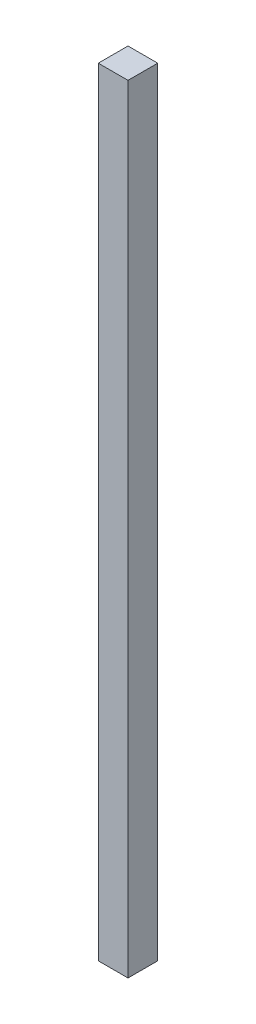
ISO-10303-21;
HEADER;
FILE_DESCRIPTION(('STEP AP214'),'2;1');
FILE_NAME('part.step','',(''),(''),'','','');
FILE_SCHEMA(('AUTOMOTIVE_DESIGN { 1 0 10303 214 1 1 1 1 }'));
ENDSEC;
DATA;
#1=APPLICATION_CONTEXT('core data for automotive mechanical design processes');
#2=APPLICATION_PROTOCOL_DEFINITION('international standard','automotive_design',2000,#1);
#3=PRODUCT_CONTEXT('',#1,'mechanical');
#4=PRODUCT('Part','Part','',(#3));
#5=PRODUCT_RELATED_PRODUCT_CATEGORY('part','',(#4));
#6=PRODUCT_DEFINITION_FORMATION('','',#4);
#7=PRODUCT_DEFINITION_CONTEXT('part definition',#1,'design');
#8=PRODUCT_DEFINITION('design','',#6,#7);
#9=PRODUCT_DEFINITION_SHAPE('','',#8);
#10=(LENGTH_UNIT() NAMED_UNIT(*) SI_UNIT(.MILLI.,.METRE.));
#11=(NAMED_UNIT(*) PLANE_ANGLE_UNIT() SI_UNIT($,.RADIAN.));
#12=(NAMED_UNIT(*) SI_UNIT($,.STERADIAN.) SOLID_ANGLE_UNIT());
#13=UNCERTAINTY_MEASURE_WITH_UNIT(LENGTH_MEASURE(1.E-05),#10,'distance_accuracy_value','');
#14=(GEOMETRIC_REPRESENTATION_CONTEXT(3) GLOBAL_UNCERTAINTY_ASSIGNED_CONTEXT((#13)) GLOBAL_UNIT_ASSIGNED_CONTEXT((#10,
#11,#12)) REPRESENTATION_CONTEXT('',''));
#15=CARTESIAN_POINT('',(0.,0.,0.));
#16=DIRECTION('',(0.,0.,1.));
#17=DIRECTION('',(1.,0.,0.));
#18=AXIS2_PLACEMENT_3D('',#15,#16,#17);
#19=CARTESIAN_POINT('',(-44.45,2324.1,44.45));
#20=DIRECTION('',(-1.,0.,0.));
#21=DIRECTION('',(0.,0.,1.));
#22=AXIS2_PLACEMENT_3D('',#19,#20,#21);
#23=PLANE('',#22);
#24=DIRECTION('',(0.,0.,-1.));
#25=VECTOR('',#24,1.);
#26=CARTESIAN_POINT('',(-44.45,0.,44.45));
#27=LINE('',#26,#25);
#28=CARTESIAN_POINT('',(-44.45,0.,44.45));
#29=VERTEX_POINT('',#28);
#30=CARTESIAN_POINT('',(-44.45,0.,-44.45));
#31=VERTEX_POINT('',#30);
#32=EDGE_CURVE('E104',#29,#31,#27,.T.);
#33=ORIENTED_EDGE('',*,*,#32,.F.);
#34=DIRECTION('',(0.,-1.,0.));
#35=VECTOR('',#34,1.);
#36=CARTESIAN_POINT('',(-44.45,2324.1,44.45));
#37=LINE('',#36,#35);
#38=CARTESIAN_POINT('',(-44.45,2324.1,44.45));
#39=VERTEX_POINT('',#38);
#40=EDGE_CURVE('E11',#39,#29,#37,.T.);
#41=ORIENTED_EDGE('',*,*,#40,.F.);
#42=DIRECTION('',(0.,0.,-1.));
#43=VECTOR('',#42,1.);
#44=CARTESIAN_POINT('',(-44.45,2324.1,44.45));
#45=LINE('',#44,#43);
#46=CARTESIAN_POINT('',(-44.45,2324.1,-44.45));
#47=VERTEX_POINT('',#46);
#48=EDGE_CURVE('E99',#39,#47,#45,.T.);
#49=ORIENTED_EDGE('',*,*,#48,.T.);
#50=DIRECTION('',(0.,-1.,0.));
#51=VECTOR('',#50,1.);
#52=CARTESIAN_POINT('',(-44.45,2324.1,-44.45));
#53=LINE('',#52,#51);
#54=EDGE_CURVE('E42',#47,#31,#53,.T.);
#55=ORIENTED_EDGE('',*,*,#54,.T.);
#56=EDGE_LOOP('',(#33,#41,#49,#55));
#57=FACE_BOUND('',#56,.T.);
#58=ADVANCED_FACE('F39',(#57),#23,.T.);
#59=CARTESIAN_POINT('',(-44.45,2324.1,44.45));
#60=DIRECTION('',(0.,0.,-1.));
#61=DIRECTION('',(-1.,0.,0.));
#62=AXIS2_PLACEMENT_3D('',#59,#60,#61);
#63=PLANE('',#62);
#64=DIRECTION('',(1.,0.,0.));
#65=VECTOR('',#64,1.);
#66=CARTESIAN_POINT('',(-44.45,0.,44.45));
#67=LINE('',#66,#65);
#68=CARTESIAN_POINT('',(44.45,0.,44.45));
#69=VERTEX_POINT('',#68);
#70=EDGE_CURVE('E72',#29,#69,#67,.T.);
#71=ORIENTED_EDGE('',*,*,#70,.T.);
#72=DIRECTION('',(0.,-1.,0.));
#73=VECTOR('',#72,1.);
#74=CARTESIAN_POINT('',(44.45,2324.1,44.45));
#75=LINE('',#74,#73);
#76=CARTESIAN_POINT('',(44.45,2324.1,44.45));
#77=VERTEX_POINT('',#76);
#78=EDGE_CURVE('E48',#77,#69,#75,.T.);
#79=ORIENTED_EDGE('',*,*,#78,.F.);
#80=DIRECTION('',(1.,0.,0.));
#81=VECTOR('',#80,1.);
#82=CARTESIAN_POINT('',(-44.45,2324.1,44.45));
#83=LINE('',#82,#81);
#84=EDGE_CURVE('E89',#39,#77,#83,.T.);
#85=ORIENTED_EDGE('',*,*,#84,.F.);
#86=ORIENTED_EDGE('',*,*,#40,.T.);
#87=EDGE_LOOP('',(#71,#79,#85,#86));
#88=FACE_BOUND('',#87,.T.);
#89=ADVANCED_FACE('F114',(#88),#63,.F.);
#90=CARTESIAN_POINT('',(44.45,2324.1,44.45));
#91=DIRECTION('',(-1.,0.,0.));
#92=DIRECTION('',(0.,0.,1.));
#93=AXIS2_PLACEMENT_3D('',#90,#91,#92);
#94=PLANE('',#93);
#95=DIRECTION('',(0.,0.,-1.));
#96=VECTOR('',#95,1.);
#97=CARTESIAN_POINT('',(44.45,0.,44.45));
#98=LINE('',#97,#96);
#99=CARTESIAN_POINT('',(44.45,0.,-44.45));
#100=VERTEX_POINT('',#99);
#101=EDGE_CURVE('E96',#69,#100,#98,.T.);
#102=ORIENTED_EDGE('',*,*,#101,.T.);
#103=DIRECTION('',(0.,-1.,0.));
#104=VECTOR('',#103,1.);
#105=CARTESIAN_POINT('',(44.45,2324.1,-44.45));
#106=LINE('',#105,#104);
#107=CARTESIAN_POINT('',(44.45,2324.1,-44.45));
#108=VERTEX_POINT('',#107);
#109=EDGE_CURVE('E93',#108,#100,#106,.T.);
#110=ORIENTED_EDGE('',*,*,#109,.F.);
#111=DIRECTION('',(0.,0.,-1.));
#112=VECTOR('',#111,1.);
#113=CARTESIAN_POINT('',(44.45,2324.1,44.45));
#114=LINE('',#113,#112);
#115=EDGE_CURVE('E84',#77,#108,#114,.T.);
#116=ORIENTED_EDGE('',*,*,#115,.F.);
#117=ORIENTED_EDGE('',*,*,#78,.T.);
#118=EDGE_LOOP('',(#102,#110,#116,#117));
#119=FACE_BOUND('',#118,.T.);
#120=ADVANCED_FACE('F94',(#119),#94,.F.);
#121=CARTESIAN_POINT('',(-44.45,2324.1,-44.45));
#122=DIRECTION('',(0.,0.,-1.));
#123=DIRECTION('',(-1.,0.,0.));
#124=AXIS2_PLACEMENT_3D('',#121,#122,#123);
#125=PLANE('',#124);
#126=DIRECTION('',(1.,0.,0.));
#127=VECTOR('',#126,1.);
#128=CARTESIAN_POINT('',(-44.45,0.,-44.45));
#129=LINE('',#128,#127);
#130=EDGE_CURVE('E107',#31,#100,#129,.T.);
#131=ORIENTED_EDGE('',*,*,#130,.F.);
#132=ORIENTED_EDGE('',*,*,#54,.F.);
#133=DIRECTION('',(1.,0.,0.));
#134=VECTOR('',#133,1.);
#135=CARTESIAN_POINT('',(-44.45,2324.1,-44.45));
#136=LINE('',#135,#134);
#137=EDGE_CURVE('E88',#47,#108,#136,.T.);
#138=ORIENTED_EDGE('',*,*,#137,.T.);
#139=ORIENTED_EDGE('',*,*,#109,.T.);
#140=EDGE_LOOP('',(#131,#132,#138,#139));
#141=FACE_BOUND('',#140,.T.);
#142=ADVANCED_FACE('F98',(#141),#125,.T.);
#143=CARTESIAN_POINT('',(0.,2324.1,0.));
#144=DIRECTION('',(0.,-1.,0.));
#145=DIRECTION('',(0.,0.,-1.));
#146=AXIS2_PLACEMENT_3D('',#143,#144,#145);
#147=PLANE('',#146);
#148=ORIENTED_EDGE('',*,*,#48,.F.);
#149=ORIENTED_EDGE('',*,*,#84,.T.);
#150=ORIENTED_EDGE('',*,*,#115,.T.);
#151=ORIENTED_EDGE('',*,*,#137,.F.);
#152=EDGE_LOOP('',(#148,#149,#150,#151));
#153=FACE_BOUND('',#152,.T.);
#154=ADVANCED_FACE('F87',(#153),#147,.F.);
#155=CARTESIAN_POINT('',(0.,0.,0.));
#156=DIRECTION('',(0.,-1.,0.));
#157=DIRECTION('',(0.,0.,-1.));
#158=AXIS2_PLACEMENT_3D('',#155,#156,#157);
#159=PLANE('',#158);
#160=ORIENTED_EDGE('',*,*,#32,.T.);
#161=ORIENTED_EDGE('',*,*,#130,.T.);
#162=ORIENTED_EDGE('',*,*,#101,.F.);
#163=ORIENTED_EDGE('',*,*,#70,.F.);
#164=EDGE_LOOP('',(#160,#161,#162,#163));
#165=FACE_BOUND('',#164,.T.);
#166=ADVANCED_FACE('F112',(#165),#159,.T.);
#167=CLOSED_SHELL('',(#58,#89,#120,#142,#154,#166));
#168=MANIFOLD_SOLID_BREP('B2',#167);
#169=ADVANCED_BREP_SHAPE_REPRESENTATION('',(#18,#168),#14);
#170=SHAPE_DEFINITION_REPRESENTATION(#9,#169);
ENDSEC;
END-ISO-10303-21;
